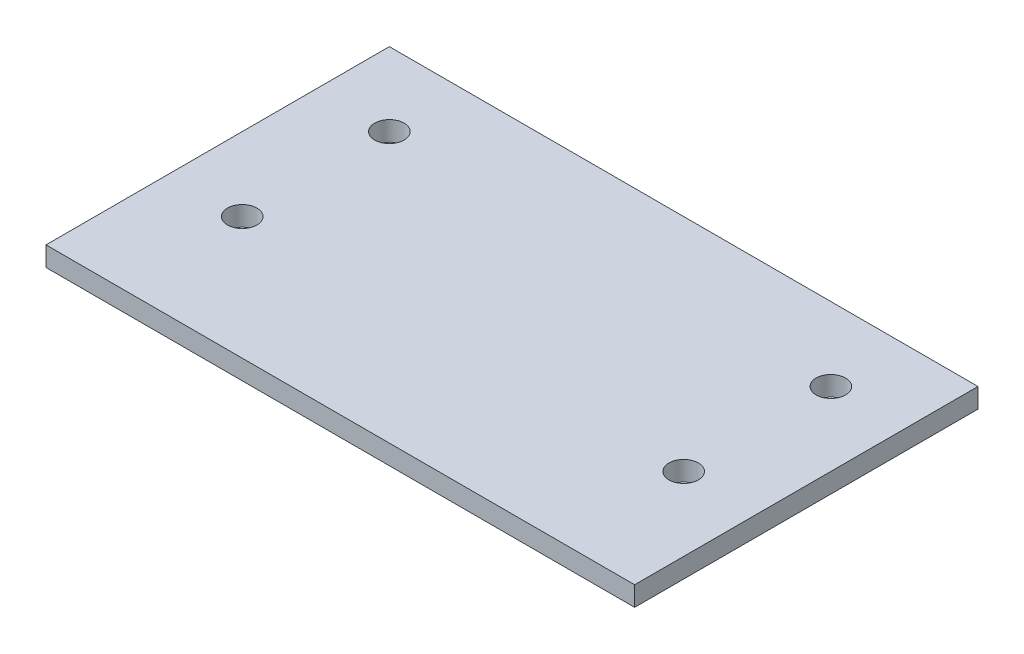
ISO-10303-21;
HEADER;
FILE_DESCRIPTION(('STEP AP214'),'2;1');
FILE_NAME('part.step','',(''),(''),'','','');
FILE_SCHEMA(('AUTOMOTIVE_DESIGN { 1 0 10303 214 1 1 1 1 }'));
ENDSEC;
DATA;
#1=APPLICATION_CONTEXT('core data for automotive mechanical design processes');
#2=APPLICATION_PROTOCOL_DEFINITION('international standard','automotive_design',2000,#1);
#3=PRODUCT_CONTEXT('',#1,'mechanical');
#4=PRODUCT('Part','Part','',(#3));
#5=PRODUCT_RELATED_PRODUCT_CATEGORY('part','',(#4));
#6=PRODUCT_DEFINITION_FORMATION('','',#4);
#7=PRODUCT_DEFINITION_CONTEXT('part definition',#1,'design');
#8=PRODUCT_DEFINITION('design','',#6,#7);
#9=PRODUCT_DEFINITION_SHAPE('','',#8);
#10=(LENGTH_UNIT() NAMED_UNIT(*) SI_UNIT(.MILLI.,.METRE.));
#11=(NAMED_UNIT(*) PLANE_ANGLE_UNIT() SI_UNIT($,.RADIAN.));
#12=(NAMED_UNIT(*) SI_UNIT($,.STERADIAN.) SOLID_ANGLE_UNIT());
#13=UNCERTAINTY_MEASURE_WITH_UNIT(LENGTH_MEASURE(1.E-05),#10,'distance_accuracy_value','');
#14=(GEOMETRIC_REPRESENTATION_CONTEXT(3) GLOBAL_UNCERTAINTY_ASSIGNED_CONTEXT((#13)) GLOBAL_UNIT_ASSIGNED_CONTEXT((#10,
#11,#12)) REPRESENTATION_CONTEXT('',''));
#15=CARTESIAN_POINT('',(0.,0.,0.));
#16=DIRECTION('',(0.,0.,1.));
#17=DIRECTION('',(1.,0.,0.));
#18=AXIS2_PLACEMENT_3D('',#15,#16,#17);
#19=CARTESIAN_POINT('',(30.,2.,17.5));
#20=DIRECTION('',(-1.,0.,0.));
#21=DIRECTION('',(0.,0.,1.));
#22=AXIS2_PLACEMENT_3D('',#19,#20,#21);
#23=PLANE('',#22);
#24=DIRECTION('',(0.,0.,-1.));
#25=VECTOR('',#24,1.);
#26=CARTESIAN_POINT('',(30.,0.,17.5));
#27=LINE('',#26,#25);
#28=CARTESIAN_POINT('',(30.,0.,17.5));
#29=VERTEX_POINT('',#28);
#30=CARTESIAN_POINT('',(30.,0.,-17.5));
#31=VERTEX_POINT('',#30);
#32=EDGE_CURVE('E96',#29,#31,#27,.T.);
#33=ORIENTED_EDGE('',*,*,#32,.T.);
#34=DIRECTION('',(0.,-1.,0.));
#35=VECTOR('',#34,1.);
#36=CARTESIAN_POINT('',(30.,2.,-17.5));
#37=LINE('',#36,#35);
#38=CARTESIAN_POINT('',(30.,2.,-17.5));
#39=VERTEX_POINT('',#38);
#40=EDGE_CURVE('E11',#39,#31,#37,.T.);
#41=ORIENTED_EDGE('',*,*,#40,.F.);
#42=DIRECTION('',(0.,0.,-1.));
#43=VECTOR('',#42,1.);
#44=CARTESIAN_POINT('',(30.,2.,17.5));
#45=LINE('',#44,#43);
#46=CARTESIAN_POINT('',(30.,2.,17.5));
#47=VERTEX_POINT('',#46);
#48=EDGE_CURVE('E84',#47,#39,#45,.T.);
#49=ORIENTED_EDGE('',*,*,#48,.F.);
#50=DIRECTION('',(0.,-1.,0.));
#51=VECTOR('',#50,1.);
#52=CARTESIAN_POINT('',(30.,2.,17.5));
#53=LINE('',#52,#51);
#54=EDGE_CURVE('E92',#47,#29,#53,.T.);
#55=ORIENTED_EDGE('',*,*,#54,.T.);
#56=EDGE_LOOP('',(#33,#41,#49,#55));
#57=FACE_BOUND('',#56,.T.);
#58=ADVANCED_FACE('F33',(#57),#23,.F.);
#59=CARTESIAN_POINT('',(-30.,2.,-17.5));
#60=DIRECTION('',(0.,0.,1.));
#61=DIRECTION('',(1.,0.,0.));
#62=AXIS2_PLACEMENT_3D('',#59,#60,#61);
#63=PLANE('',#62);
#64=DIRECTION('',(-1.,0.,0.));
#65=VECTOR('',#64,1.);
#66=CARTESIAN_POINT('',(-30.,0.,-17.5));
#67=LINE('',#66,#65);
#68=CARTESIAN_POINT('',(-30.,0.,-17.5));
#69=VERTEX_POINT('',#68);
#70=EDGE_CURVE('E88',#31,#69,#67,.T.);
#71=ORIENTED_EDGE('',*,*,#70,.T.);
#72=DIRECTION('',(0.,-1.,0.));
#73=VECTOR('',#72,1.);
#74=CARTESIAN_POINT('',(-30.,2.,-17.5));
#75=LINE('',#74,#73);
#76=CARTESIAN_POINT('',(-30.,2.,-17.5));
#77=VERTEX_POINT('',#76);
#78=EDGE_CURVE('E41',#77,#69,#75,.T.);
#79=ORIENTED_EDGE('',*,*,#78,.F.);
#80=DIRECTION('',(-1.,0.,0.));
#81=VECTOR('',#80,1.);
#82=CARTESIAN_POINT('',(-30.,2.,-17.5));
#83=LINE('',#82,#81);
#84=EDGE_CURVE('E79',#39,#77,#83,.T.);
#85=ORIENTED_EDGE('',*,*,#84,.F.);
#86=ORIENTED_EDGE('',*,*,#40,.T.);
#87=EDGE_LOOP('',(#71,#79,#85,#86));
#88=FACE_BOUND('',#87,.T.);
#89=ADVANCED_FACE('F87',(#88),#63,.F.);
#90=CARTESIAN_POINT('',(-30.,2.,17.5));
#91=DIRECTION('',(1.,0.,0.));
#92=DIRECTION('',(0.,0.,-1.));
#93=AXIS2_PLACEMENT_3D('',#90,#91,#92);
#94=PLANE('',#93);
#95=DIRECTION('',(0.,0.,1.));
#96=VECTOR('',#95,1.);
#97=CARTESIAN_POINT('',(-30.,0.,17.5));
#98=LINE('',#97,#96);
#99=CARTESIAN_POINT('',(-30.,0.,17.5));
#100=VERTEX_POINT('',#99);
#101=EDGE_CURVE('E66',#69,#100,#98,.T.);
#102=ORIENTED_EDGE('',*,*,#101,.T.);
#103=DIRECTION('',(0.,-1.,0.));
#104=VECTOR('',#103,1.);
#105=CARTESIAN_POINT('',(-30.,2.,17.5));
#106=LINE('',#105,#104);
#107=CARTESIAN_POINT('',(-30.,2.,17.5));
#108=VERTEX_POINT('',#107);
#109=EDGE_CURVE('E89',#108,#100,#106,.T.);
#110=ORIENTED_EDGE('',*,*,#109,.F.);
#111=DIRECTION('',(0.,0.,1.));
#112=VECTOR('',#111,1.);
#113=CARTESIAN_POINT('',(-30.,2.,17.5));
#114=LINE('',#113,#112);
#115=EDGE_CURVE('E82',#77,#108,#114,.T.);
#116=ORIENTED_EDGE('',*,*,#115,.F.);
#117=ORIENTED_EDGE('',*,*,#78,.T.);
#118=EDGE_LOOP('',(#102,#110,#116,#117));
#119=FACE_BOUND('',#118,.T.);
#120=ADVANCED_FACE('F90',(#119),#94,.F.);
#121=CARTESIAN_POINT('',(-30.,2.,17.5));
#122=DIRECTION('',(0.,0.,-1.));
#123=DIRECTION('',(-1.,0.,0.));
#124=AXIS2_PLACEMENT_3D('',#121,#122,#123);
#125=PLANE('',#124);
#126=DIRECTION('',(1.,0.,0.));
#127=VECTOR('',#126,1.);
#128=CARTESIAN_POINT('',(-30.,0.,17.5));
#129=LINE('',#128,#127);
#130=EDGE_CURVE('E72',#100,#29,#129,.T.);
#131=ORIENTED_EDGE('',*,*,#130,.T.);
#132=ORIENTED_EDGE('',*,*,#54,.F.);
#133=DIRECTION('',(1.,0.,0.));
#134=VECTOR('',#133,1.);
#135=CARTESIAN_POINT('',(-30.,2.,17.5));
#136=LINE('',#135,#134);
#137=EDGE_CURVE('E49',#108,#47,#136,.T.);
#138=ORIENTED_EDGE('',*,*,#137,.F.);
#139=ORIENTED_EDGE('',*,*,#109,.T.);
#140=EDGE_LOOP('',(#131,#132,#138,#139));
#141=FACE_BOUND('',#140,.T.);
#142=ADVANCED_FACE('F104',(#141),#125,.F.);
#143=CARTESIAN_POINT('',(0.,2.,0.));
#144=DIRECTION('',(0.,-1.,0.));
#145=DIRECTION('',(0.,0.,-1.));
#146=AXIS2_PLACEMENT_3D('',#143,#144,#145);
#147=PLANE('',#146);
#148=CARTESIAN_POINT('',(22.4999999999998,2.,4.99999999999963));
#149=DIRECTION('',(0.,-1.,0.));
#150=DIRECTION('',(0.,0.,-1.));
#151=AXIS2_PLACEMENT_3D('',#148,#149,#150);
#152=CIRCLE('',#151,1.5);
#153=CARTESIAN_POINT('',(22.4999999999998,2.,3.49999999999963));
#154=VERTEX_POINT('',#153);
#155=EDGE_CURVE('E115',#154,#154,#152,.F.);
#156=ORIENTED_EDGE('',*,*,#155,.F.);
#157=EDGE_LOOP('',(#156));
#158=FACE_BOUND('',#157,.T.);
#159=CARTESIAN_POINT('',(-22.5000000000002,2.,-10.0000000000003));
#160=DIRECTION('',(0.,-1.,0.));
#161=DIRECTION('',(0.,0.,-1.));
#162=AXIS2_PLACEMENT_3D('',#159,#160,#161);
#163=CIRCLE('',#162,1.5);
#164=CARTESIAN_POINT('',(-22.5000000000002,2.,-11.5000000000003));
#165=VERTEX_POINT('',#164);
#166=EDGE_CURVE('E116',#165,#165,#163,.F.);
#167=ORIENTED_EDGE('',*,*,#166,.F.);
#168=EDGE_LOOP('',(#167));
#169=FACE_BOUND('',#168,.T.);
#170=CARTESIAN_POINT('',(-22.5000000000002,2.,4.99999999999973));
#171=DIRECTION('',(0.,-1.,0.));
#172=DIRECTION('',(0.,0.,-1.));
#173=AXIS2_PLACEMENT_3D('',#170,#171,#172);
#174=CIRCLE('',#173,1.5);
#175=CARTESIAN_POINT('',(-22.5000000000002,2.,3.49999999999973));
#176=VERTEX_POINT('',#175);
#177=EDGE_CURVE('E123',#176,#176,#174,.F.);
#178=ORIENTED_EDGE('',*,*,#177,.F.);
#179=EDGE_LOOP('',(#178));
#180=FACE_BOUND('',#179,.T.);
#181=CARTESIAN_POINT('',(22.4999999999998,2.,-10.0000000000004));
#182=DIRECTION('',(0.,-1.,0.));
#183=DIRECTION('',(0.,0.,-1.));
#184=AXIS2_PLACEMENT_3D('',#181,#182,#183);
#185=CIRCLE('',#184,1.5);
#186=CARTESIAN_POINT('',(22.4999999999998,2.,-11.5000000000004));
#187=VERTEX_POINT('',#186);
#188=EDGE_CURVE('E99',#187,#187,#185,.F.);
#189=ORIENTED_EDGE('',*,*,#188,.F.);
#190=EDGE_LOOP('',(#189));
#191=FACE_BOUND('',#190,.T.);
#192=ORIENTED_EDGE('',*,*,#48,.T.);
#193=ORIENTED_EDGE('',*,*,#84,.T.);
#194=ORIENTED_EDGE('',*,*,#115,.T.);
#195=ORIENTED_EDGE('',*,*,#137,.T.);
#196=EDGE_LOOP('',(#192,#193,#194,#195));
#197=FACE_BOUND('',#196,.T.);
#198=ADVANCED_FACE('F80',(#158,#169,#180,#191,#197),#147,.F.);
#199=CARTESIAN_POINT('',(0.,0.,0.));
#200=DIRECTION('',(0.,-1.,0.));
#201=DIRECTION('',(0.,0.,-1.));
#202=AXIS2_PLACEMENT_3D('',#199,#200,#201);
#203=PLANE('',#202);
#204=CARTESIAN_POINT('',(22.4999999999998,0.,4.99999999999963));
#205=DIRECTION('',(0.,-1.,0.));
#206=DIRECTION('',(0.,0.,-1.));
#207=AXIS2_PLACEMENT_3D('',#204,#205,#206);
#208=CIRCLE('',#207,1.5);
#209=CARTESIAN_POINT('',(22.4999999999998,0.,3.49999999999963));
#210=VERTEX_POINT('',#209);
#211=EDGE_CURVE('E119',#210,#210,#208,.T.);
#212=ORIENTED_EDGE('',*,*,#211,.F.);
#213=EDGE_LOOP('',(#212));
#214=FACE_BOUND('',#213,.T.);
#215=CARTESIAN_POINT('',(-22.5000000000002,0.,-10.0000000000003));
#216=DIRECTION('',(0.,-1.,0.));
#217=DIRECTION('',(0.,0.,-1.));
#218=AXIS2_PLACEMENT_3D('',#215,#216,#217);
#219=CIRCLE('',#218,1.5);
#220=CARTESIAN_POINT('',(-22.5000000000002,0.,-11.5000000000003));
#221=VERTEX_POINT('',#220);
#222=EDGE_CURVE('E120',#221,#221,#219,.T.);
#223=ORIENTED_EDGE('',*,*,#222,.F.);
#224=EDGE_LOOP('',(#223));
#225=FACE_BOUND('',#224,.T.);
#226=CARTESIAN_POINT('',(-22.5000000000002,0.,4.99999999999973));
#227=DIRECTION('',(0.,-1.,0.));
#228=DIRECTION('',(0.,0.,-1.));
#229=AXIS2_PLACEMENT_3D('',#226,#227,#228);
#230=CIRCLE('',#229,1.5);
#231=CARTESIAN_POINT('',(-22.5000000000002,0.,3.49999999999973));
#232=VERTEX_POINT('',#231);
#233=EDGE_CURVE('E130',#232,#232,#230,.T.);
#234=ORIENTED_EDGE('',*,*,#233,.F.);
#235=EDGE_LOOP('',(#234));
#236=FACE_BOUND('',#235,.T.);
#237=CARTESIAN_POINT('',(22.4999999999998,0.,-10.0000000000004));
#238=DIRECTION('',(0.,-1.,0.));
#239=DIRECTION('',(0.,0.,-1.));
#240=AXIS2_PLACEMENT_3D('',#237,#238,#239);
#241=CIRCLE('',#240,1.5);
#242=CARTESIAN_POINT('',(22.4999999999998,0.,-11.5000000000004));
#243=VERTEX_POINT('',#242);
#244=EDGE_CURVE('E112',#243,#243,#241,.T.);
#245=ORIENTED_EDGE('',*,*,#244,.F.);
#246=EDGE_LOOP('',(#245));
#247=FACE_BOUND('',#246,.T.);
#248=ORIENTED_EDGE('',*,*,#32,.F.);
#249=ORIENTED_EDGE('',*,*,#130,.F.);
#250=ORIENTED_EDGE('',*,*,#101,.F.);
#251=ORIENTED_EDGE('',*,*,#70,.F.);
#252=EDGE_LOOP('',(#248,#249,#250,#251));
#253=FACE_BOUND('',#252,.T.);
#254=ADVANCED_FACE('F107',(#214,#225,#236,#247,#253),#203,.T.);
#255=CARTESIAN_POINT('',(22.4999999999998,2.001,-10.0000000000004));
#256=DIRECTION('',(0.,-1.,0.));
#257=DIRECTION('',(0.,0.,-1.));
#258=AXIS2_PLACEMENT_3D('',#255,#256,#257);
#259=CYLINDRICAL_SURFACE('',#258,1.5);
#260=ORIENTED_EDGE('',*,*,#244,.T.);
#261=EDGE_LOOP('',(#260));
#262=FACE_BOUND('',#261,.T.);
#263=ORIENTED_EDGE('',*,*,#188,.T.);
#264=EDGE_LOOP('',(#263));
#265=FACE_BOUND('',#264,.T.);
#266=ADVANCED_FACE('F139',(#262,#265),#259,.F.);
#267=CARTESIAN_POINT('',(-22.5000000000002,2.001,4.99999999999973));
#268=DIRECTION('',(0.,-1.,0.));
#269=DIRECTION('',(0.,0.,-1.));
#270=AXIS2_PLACEMENT_3D('',#267,#268,#269);
#271=CYLINDRICAL_SURFACE('',#270,1.5);
#272=ORIENTED_EDGE('',*,*,#233,.T.);
#273=EDGE_LOOP('',(#272));
#274=FACE_BOUND('',#273,.T.);
#275=ORIENTED_EDGE('',*,*,#177,.T.);
#276=EDGE_LOOP('',(#275));
#277=FACE_BOUND('',#276,.T.);
#278=ADVANCED_FACE('F134',(#274,#277),#271,.F.);
#279=CARTESIAN_POINT('',(-22.5000000000002,2.001,-10.0000000000003));
#280=DIRECTION('',(0.,-1.,0.));
#281=DIRECTION('',(0.,0.,-1.));
#282=AXIS2_PLACEMENT_3D('',#279,#280,#281);
#283=CYLINDRICAL_SURFACE('',#282,1.5);
#284=ORIENTED_EDGE('',*,*,#222,.T.);
#285=EDGE_LOOP('',(#284));
#286=FACE_BOUND('',#285,.T.);
#287=ORIENTED_EDGE('',*,*,#166,.T.);
#288=EDGE_LOOP('',(#287));
#289=FACE_BOUND('',#288,.T.);
#290=ADVANCED_FACE('F192',(#286,#289),#283,.F.);
#291=CARTESIAN_POINT('',(22.4999999999998,2.001,4.99999999999963));
#292=DIRECTION('',(0.,-1.,0.));
#293=DIRECTION('',(0.,0.,-1.));
#294=AXIS2_PLACEMENT_3D('',#291,#292,#293);
#295=CYLINDRICAL_SURFACE('',#294,1.5);
#296=ORIENTED_EDGE('',*,*,#211,.T.);
#297=EDGE_LOOP('',(#296));
#298=FACE_BOUND('',#297,.T.);
#299=ORIENTED_EDGE('',*,*,#155,.T.);
#300=EDGE_LOOP('',(#299));
#301=FACE_BOUND('',#300,.T.);
#302=ADVANCED_FACE('F199',(#298,#301),#295,.F.);
#303=CLOSED_SHELL('',(#58,#89,#120,#142,#198,#254,#266,#278,#290,#302));
#304=MANIFOLD_SOLID_BREP('B2',#303);
#305=ADVANCED_BREP_SHAPE_REPRESENTATION('',(#18,#304),#14);
#306=SHAPE_DEFINITION_REPRESENTATION(#9,#305);
ENDSEC;
END-ISO-10303-21;
